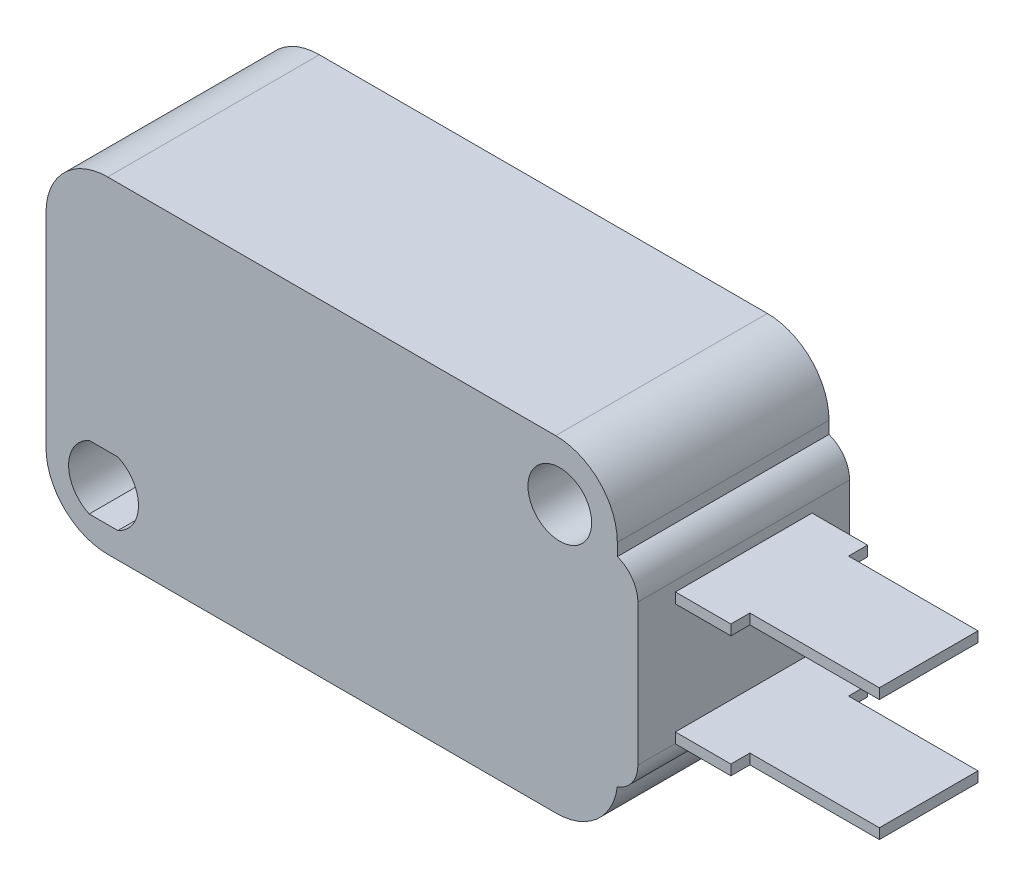
ISO-10303-21;
HEADER;
FILE_DESCRIPTION(('STEP AP214'),'2;1');
FILE_NAME('part.step','',(''),(''),'','','');
FILE_SCHEMA(('AUTOMOTIVE_DESIGN { 1 0 10303 214 1 1 1 1 }'));
ENDSEC;
DATA;
#1=APPLICATION_CONTEXT('core data for automotive mechanical design processes');
#2=APPLICATION_PROTOCOL_DEFINITION('international standard','automotive_design',2000,#1);
#3=PRODUCT_CONTEXT('',#1,'mechanical');
#4=PRODUCT('Part','Part','',(#3));
#5=PRODUCT_RELATED_PRODUCT_CATEGORY('part','',(#4));
#6=PRODUCT_DEFINITION_FORMATION('','',#4);
#7=PRODUCT_DEFINITION_CONTEXT('part definition',#1,'design');
#8=PRODUCT_DEFINITION('design','',#6,#7);
#9=PRODUCT_DEFINITION_SHAPE('','',#8);
#10=(LENGTH_UNIT() NAMED_UNIT(*) SI_UNIT(.MILLI.,.METRE.));
#11=(NAMED_UNIT(*) PLANE_ANGLE_UNIT() SI_UNIT($,.RADIAN.));
#12=(NAMED_UNIT(*) SI_UNIT($,.STERADIAN.) SOLID_ANGLE_UNIT());
#13=UNCERTAINTY_MEASURE_WITH_UNIT(LENGTH_MEASURE(1.E-05),#10,'distance_accuracy_value','');
#14=(GEOMETRIC_REPRESENTATION_CONTEXT(3) GLOBAL_UNCERTAINTY_ASSIGNED_CONTEXT((#13)) GLOBAL_UNIT_ASSIGNED_CONTEXT((#10,
#11,#12)) REPRESENTATION_CONTEXT('',''));
#15=CARTESIAN_POINT('',(0.,0.,0.));
#16=DIRECTION('',(0.,0.,1.));
#17=DIRECTION('',(1.,0.,0.));
#18=AXIS2_PLACEMENT_3D('',#15,#16,#17);
#19=CARTESIAN_POINT('',(3.8,-0.8,5.15));
#20=DIRECTION('',(-1.,0.,0.));
#21=DIRECTION('',(0.,-1.,0.));
#22=AXIS2_PLACEMENT_3D('',#19,#20,#21);
#23=PLANE('',#22);
#24=DIRECTION('',(0.,-1.,0.));
#25=VECTOR('',#24,1.);
#26=CARTESIAN_POINT('',(3.8,-2.7,3.325));
#27=LINE('',#26,#25);
#28=CARTESIAN_POINT('',(3.8,-2.7,3.325));
#29=VERTEX_POINT('',#28);
#30=CARTESIAN_POINT('',(3.8,-3.2,3.325));
#31=VERTEX_POINT('',#30);
#32=EDGE_CURVE('E455',#29,#31,#27,.T.);
#33=ORIENTED_EDGE('',*,*,#32,.F.);
#34=DIRECTION('',(0.,0.,1.));
#35=VECTOR('',#34,1.);
#36=CARTESIAN_POINT('',(3.8,-2.7,3.325));
#37=LINE('',#36,#35);
#38=CARTESIAN_POINT('',(3.8,-2.7,-3.325));
#39=VERTEX_POINT('',#38);
#40=EDGE_CURVE('E462',#39,#29,#37,.T.);
#41=ORIENTED_EDGE('',*,*,#40,.F.);
#42=DIRECTION('',(0.,1.,0.));
#43=VECTOR('',#42,1.);
#44=CARTESIAN_POINT('',(3.8,-2.7,-3.325));
#45=LINE('',#44,#43);
#46=CARTESIAN_POINT('',(3.8,-3.2,-3.325));
#47=VERTEX_POINT('',#46);
#48=EDGE_CURVE('E271',#47,#39,#45,.T.);
#49=ORIENTED_EDGE('',*,*,#48,.F.);
#50=DIRECTION('',(0.,0.,-1.));
#51=VECTOR('',#50,1.);
#52=CARTESIAN_POINT('',(3.8,-3.2,3.325));
#53=LINE('',#52,#51);
#54=EDGE_CURVE('E458',#31,#47,#53,.T.);
#55=ORIENTED_EDGE('',*,*,#54,.F.);
#56=EDGE_LOOP('',(#33,#41,#49,#55));
#57=FACE_BOUND('',#56,.T.);
#58=DIRECTION('',(0.,1.,0.));
#59=VECTOR('',#58,1.);
#60=CARTESIAN_POINT('',(3.8,-0.8,5.15));
#61=LINE('',#60,#59);
#62=CARTESIAN_POINT('',(3.8,-9.08578643762691,5.15));
#63=VERTEX_POINT('',#62);
#64=CARTESIAN_POINT('',(3.8,-2.2142135623731,5.15));
#65=VERTEX_POINT('',#64);
#66=EDGE_CURVE('E340',#63,#65,#61,.T.);
#67=ORIENTED_EDGE('',*,*,#66,.F.);
#68=DIRECTION('',(0.,0.,-1.));
#69=VECTOR('',#68,1.);
#70=CARTESIAN_POINT('',(3.8,-9.08578643762691,5.15));
#71=LINE('',#70,#69);
#72=CARTESIAN_POINT('',(3.8,-9.08578643762691,3.325));
#73=VERTEX_POINT('',#72);
#74=EDGE_CURVE('E403',#63,#73,#71,.T.);
#75=ORIENTED_EDGE('',*,*,#74,.T.);
#76=DIRECTION('',(0.,-1.,0.));
#77=VECTOR('',#76,1.);
#78=CARTESIAN_POINT('',(3.8,-8.6,3.325));
#79=LINE('',#78,#77);
#80=CARTESIAN_POINT('',(3.8,-8.6,3.325));
#81=VERTEX_POINT('',#80);
#82=EDGE_CURVE('E436',#81,#73,#79,.T.);
#83=ORIENTED_EDGE('',*,*,#82,.F.);
#84=DIRECTION('',(0.,0.,1.));
#85=VECTOR('',#84,1.);
#86=CARTESIAN_POINT('',(3.8,-8.6,3.325));
#87=LINE('',#86,#85);
#88=CARTESIAN_POINT('',(3.8,-8.6,-3.325));
#89=VERTEX_POINT('',#88);
#90=EDGE_CURVE('E435',#89,#81,#87,.T.);
#91=ORIENTED_EDGE('',*,*,#90,.F.);
#92=DIRECTION('',(0.,1.,0.));
#93=VECTOR('',#92,1.);
#94=CARTESIAN_POINT('',(3.8,-8.6,-3.325));
#95=LINE('',#94,#93);
#96=CARTESIAN_POINT('',(3.8,-9.08578643762691,-3.325));
#97=VERTEX_POINT('',#96);
#98=EDGE_CURVE('E427',#97,#89,#95,.T.);
#99=ORIENTED_EDGE('',*,*,#98,.F.);
#100=DIRECTION('',(0.,0.,-1.));
#101=VECTOR('',#100,1.);
#102=CARTESIAN_POINT('',(3.8,-9.08578643762691,5.15));
#103=LINE('',#102,#101);
#104=CARTESIAN_POINT('',(3.8,-9.08578643762691,-5.15));
#105=VERTEX_POINT('',#104);
#106=EDGE_CURVE('E401',#97,#105,#103,.T.);
#107=ORIENTED_EDGE('',*,*,#106,.T.);
#108=DIRECTION('',(0.,1.,0.));
#109=VECTOR('',#108,1.);
#110=CARTESIAN_POINT('',(3.8,-0.8,-5.15));
#111=LINE('',#110,#109);
#112=CARTESIAN_POINT('',(3.8,-2.2142135623731,-5.15));
#113=VERTEX_POINT('',#112);
#114=EDGE_CURVE('E325',#105,#113,#111,.T.);
#115=ORIENTED_EDGE('',*,*,#114,.T.);
#116=DIRECTION('',(0.,0.,-1.));
#117=VECTOR('',#116,1.);
#118=CARTESIAN_POINT('',(3.8,-2.2142135623731,5.15));
#119=LINE('',#118,#117);
#120=EDGE_CURVE('E399',#113,#65,#119,.F.);
#121=ORIENTED_EDGE('',*,*,#120,.T.);
#122=EDGE_LOOP('',(#67,#75,#83,#91,#99,#107,#115,#121));
#123=FACE_BOUND('',#122,.T.);
#124=ADVANCED_FACE('F37',(#57,#123),#23,.F.);
#125=CARTESIAN_POINT('',(-25.,2.8,5.15));
#126=DIRECTION('',(0.,-1.,0.));
#127=DIRECTION('',(0.,0.,-1.));
#128=AXIS2_PLACEMENT_3D('',#125,#126,#127);
#129=PLANE('',#128);
#130=DIRECTION('',(-1.,0.,0.));
#131=VECTOR('',#130,1.);
#132=CARTESIAN_POINT('',(-25.,2.8,-5.15));
#133=LINE('',#132,#131);
#134=CARTESIAN_POINT('',(-0.199999999999999,2.8,-5.15));
#135=VERTEX_POINT('',#134);
#136=CARTESIAN_POINT('',(-22.,2.8,-5.15));
#137=VERTEX_POINT('',#136);
#138=EDGE_CURVE('E331',#135,#137,#133,.T.);
#139=ORIENTED_EDGE('',*,*,#138,.T.);
#140=DIRECTION('',(0.,0.,-1.));
#141=VECTOR('',#140,1.);
#142=CARTESIAN_POINT('',(-22.,2.8,5.15));
#143=LINE('',#142,#141);
#144=CARTESIAN_POINT('',(-22.,2.8,5.15));
#145=VERTEX_POINT('',#144);
#146=EDGE_CURVE('E382',#137,#145,#143,.F.);
#147=ORIENTED_EDGE('',*,*,#146,.T.);
#148=DIRECTION('',(-1.,0.,0.));
#149=VECTOR('',#148,1.);
#150=CARTESIAN_POINT('',(-25.,2.8,5.15));
#151=LINE('',#150,#149);
#152=CARTESIAN_POINT('',(-0.199999999999999,2.8,5.15));
#153=VERTEX_POINT('',#152);
#154=EDGE_CURVE('E346',#153,#145,#151,.T.);
#155=ORIENTED_EDGE('',*,*,#154,.F.);
#156=DIRECTION('',(0.,0.,-1.));
#157=VECTOR('',#156,1.);
#158=CARTESIAN_POINT('',(-0.199999999999999,2.8,5.15));
#159=LINE('',#158,#157);
#160=EDGE_CURVE('E379',#153,#135,#159,.T.);
#161=ORIENTED_EDGE('',*,*,#160,.T.);
#162=EDGE_LOOP('',(#139,#147,#155,#161));
#163=FACE_BOUND('',#162,.T.);
#164=ADVANCED_FACE('F549',(#163),#129,.F.);
#165=CARTESIAN_POINT('',(-25.,-13.1,5.15));
#166=DIRECTION('',(0.,0.,1.));
#167=DIRECTION('',(1.,0.,0.));
#168=AXIS2_PLACEMENT_3D('',#165,#166,#167);
#169=PLANE('',#168);
#170=CARTESIAN_POINT('',(0.,0.,5.15));
#171=DIRECTION('',(0.,0.,1.));
#172=DIRECTION('',(1.,0.,0.));
#173=AXIS2_PLACEMENT_3D('',#170,#171,#172);
#174=CIRCLE('',#173,1.55);
#175=CARTESIAN_POINT('',(1.55,0.,5.15));
#176=VERTEX_POINT('',#175);
#177=EDGE_CURVE('E316',#176,#176,#174,.T.);
#178=ORIENTED_EDGE('',*,*,#177,.F.);
#179=EDGE_LOOP('',(#178));
#180=FACE_BOUND('',#179,.T.);
#181=CARTESIAN_POINT('',(-0.173213749463701,-10.1,5.15));
#182=DIRECTION('',(0.,0.,1.));
#183=DIRECTION('',(1.,0.,0.));
#184=AXIS2_PLACEMENT_3D('',#181,#182,#183);
#185=CIRCLE('',#184,3.);
#186=CARTESIAN_POINT('',(-0.173213749463701,-13.1,5.15));
#187=VERTEX_POINT('',#186);
#188=CARTESIAN_POINT('',(2.8,-10.5,5.15));
#189=VERTEX_POINT('',#188);
#190=EDGE_CURVE('E386',#187,#189,#185,.T.);
#191=ORIENTED_EDGE('',*,*,#190,.T.);
#192=CARTESIAN_POINT('',(2.3,-9.08578643762691,5.15));
#193=DIRECTION('',(0.,0.,1.));
#194=DIRECTION('',(1.,0.,0.));
#195=AXIS2_PLACEMENT_3D('',#192,#193,#194);
#196=CIRCLE('',#195,1.5);
#197=EDGE_CURVE('E412',#189,#63,#196,.T.);
#198=ORIENTED_EDGE('',*,*,#197,.T.);
#199=ORIENTED_EDGE('',*,*,#66,.T.);
#200=CARTESIAN_POINT('',(2.3,-2.2142135623731,5.15));
#201=DIRECTION('',(0.,0.,1.));
#202=DIRECTION('',(1.,0.,0.));
#203=AXIS2_PLACEMENT_3D('',#200,#201,#202);
#204=CIRCLE('',#203,1.5);
#205=CARTESIAN_POINT('',(2.8,-0.8,5.15));
#206=VERTEX_POINT('',#205);
#207=EDGE_CURVE('E410',#65,#206,#204,.T.);
#208=ORIENTED_EDGE('',*,*,#207,.T.);
#209=DIRECTION('',(0.,1.,0.));
#210=VECTOR('',#209,1.);
#211=CARTESIAN_POINT('',(2.8,2.8,5.15));
#212=LINE('',#211,#210);
#213=CARTESIAN_POINT('',(2.8,-0.2,5.15));
#214=VERTEX_POINT('',#213);
#215=EDGE_CURVE('E343',#206,#214,#212,.T.);
#216=ORIENTED_EDGE('',*,*,#215,.T.);
#217=CARTESIAN_POINT('',(-0.199999999999999,-0.2,5.15));
#218=DIRECTION('',(0.,0.,1.));
#219=DIRECTION('',(1.,0.,0.));
#220=AXIS2_PLACEMENT_3D('',#217,#218,#219);
#221=CIRCLE('',#220,3.);
#222=EDGE_CURVE('E384',#214,#153,#221,.T.);
#223=ORIENTED_EDGE('',*,*,#222,.T.);
#224=ORIENTED_EDGE('',*,*,#154,.T.);
#225=CARTESIAN_POINT('',(-22.,-0.2,5.15));
#226=DIRECTION('',(0.,0.,1.));
#227=DIRECTION('',(1.,0.,0.));
#228=AXIS2_PLACEMENT_3D('',#225,#226,#227);
#229=CIRCLE('',#228,3.);
#230=CARTESIAN_POINT('',(-25.,-0.2,5.15));
#231=VERTEX_POINT('',#230);
#232=EDGE_CURVE('E390',#145,#231,#229,.T.);
#233=ORIENTED_EDGE('',*,*,#232,.T.);
#234=DIRECTION('',(0.,-1.,0.));
#235=VECTOR('',#234,1.);
#236=CARTESIAN_POINT('',(-25.,2.8,5.15));
#237=LINE('',#236,#235);
#238=CARTESIAN_POINT('',(-25.,-10.1,5.15));
#239=VERTEX_POINT('',#238);
#240=EDGE_CURVE('E334',#231,#239,#237,.T.);
#241=ORIENTED_EDGE('',*,*,#240,.T.);
#242=CARTESIAN_POINT('',(-22.,-10.1,5.15));
#243=DIRECTION('',(0.,0.,1.));
#244=DIRECTION('',(1.,0.,0.));
#245=AXIS2_PLACEMENT_3D('',#242,#243,#244);
#246=CIRCLE('',#245,3.);
#247=CARTESIAN_POINT('',(-22.,-13.1,5.15));
#248=VERTEX_POINT('',#247);
#249=EDGE_CURVE('E388',#239,#248,#246,.T.);
#250=ORIENTED_EDGE('',*,*,#249,.T.);
#251=DIRECTION('',(1.,0.,0.));
#252=VECTOR('',#251,1.);
#253=CARTESIAN_POINT('',(-25.,-13.1,5.15));
#254=LINE('',#253,#252);
#255=EDGE_CURVE('E337',#248,#187,#254,.T.);
#256=ORIENTED_EDGE('',*,*,#255,.T.);
#257=EDGE_LOOP('',(#191,#198,#199,#208,#216,#223,#224,#233,#241,#250,#256));
#258=FACE_BOUND('',#257,.T.);
#259=DIRECTION('',(1.,0.,0.));
#260=VECTOR('',#259,1.);
#261=CARTESIAN_POINT('',(-22.8982120021885,-11.85,5.15));
#262=LINE('',#261,#260);
#263=CARTESIAN_POINT('',(-22.8982120021885,-11.85,5.15));
#264=VERTEX_POINT('',#263);
#265=CARTESIAN_POINT('',(-21.5017879978116,-11.85,5.15));
#266=VERTEX_POINT('',#265);
#267=EDGE_CURVE('E296',#264,#266,#262,.T.);
#268=ORIENTED_EDGE('',*,*,#267,.F.);
#269=CARTESIAN_POINT('',(-22.2,-10.3,5.15));
#270=DIRECTION('',(0.,0.,1.));
#271=DIRECTION('',(1.,0.,0.));
#272=AXIS2_PLACEMENT_3D('',#269,#270,#271);
#273=CIRCLE('',#272,1.7);
#274=CARTESIAN_POINT('',(-22.8982120021885,-8.75,5.15));
#275=VERTEX_POINT('',#274);
#276=EDGE_CURVE('E294',#275,#264,#273,.T.);
#277=ORIENTED_EDGE('',*,*,#276,.F.);
#278=DIRECTION('',(-1.,0.,0.));
#279=VECTOR('',#278,1.);
#280=CARTESIAN_POINT('',(-22.8982120021885,-8.75,5.15));
#281=LINE('',#280,#279);
#282=CARTESIAN_POINT('',(-21.5017879978116,-8.75,5.15));
#283=VERTEX_POINT('',#282);
#284=EDGE_CURVE('E301',#283,#275,#281,.T.);
#285=ORIENTED_EDGE('',*,*,#284,.F.);
#286=CARTESIAN_POINT('',(-22.2,-10.3,5.15));
#287=DIRECTION('',(0.,0.,1.));
#288=DIRECTION('',(1.,0.,0.));
#289=AXIS2_PLACEMENT_3D('',#286,#287,#288);
#290=CIRCLE('',#289,1.7);
#291=EDGE_CURVE('E298',#266,#283,#290,.T.);
#292=ORIENTED_EDGE('',*,*,#291,.F.);
#293=EDGE_LOOP('',(#268,#277,#285,#292));
#294=FACE_BOUND('',#293,.T.);
#295=ADVANCED_FACE('F554',(#180,#258,#294),#169,.T.);
#296=CARTESIAN_POINT('',(-25.,-13.1,-5.15));
#297=DIRECTION('',(0.,0.,1.));
#298=DIRECTION('',(1.,0.,0.));
#299=AXIS2_PLACEMENT_3D('',#296,#297,#298);
#300=PLANE('',#299);
#301=CARTESIAN_POINT('',(0.,0.,-5.15));
#302=DIRECTION('',(0.,0.,1.));
#303=DIRECTION('',(1.,0.,0.));
#304=AXIS2_PLACEMENT_3D('',#301,#302,#303);
#305=CIRCLE('',#304,1.55);
#306=CARTESIAN_POINT('',(1.55,0.,-5.15));
#307=VERTEX_POINT('',#306);
#308=EDGE_CURVE('E313',#307,#307,#305,.T.);
#309=ORIENTED_EDGE('',*,*,#308,.T.);
#310=EDGE_LOOP('',(#309));
#311=FACE_BOUND('',#310,.T.);
#312=ORIENTED_EDGE('',*,*,#114,.F.);
#313=CARTESIAN_POINT('',(2.3,-9.08578643762691,-5.15));
#314=DIRECTION('',(0.,0.,1.));
#315=DIRECTION('',(1.,0.,0.));
#316=AXIS2_PLACEMENT_3D('',#313,#314,#315);
#317=CIRCLE('',#316,1.5);
#318=CARTESIAN_POINT('',(2.8,-10.5,-5.15));
#319=VERTEX_POINT('',#318);
#320=EDGE_CURVE('E408',#105,#319,#317,.F.);
#321=ORIENTED_EDGE('',*,*,#320,.T.);
#322=CARTESIAN_POINT('',(-0.173213749463701,-10.1,-5.15));
#323=DIRECTION('',(0.,0.,1.));
#324=DIRECTION('',(1.,0.,0.));
#325=AXIS2_PLACEMENT_3D('',#322,#323,#324);
#326=CIRCLE('',#325,3.);
#327=CARTESIAN_POINT('',(-0.173213749463701,-13.1,-5.15));
#328=VERTEX_POINT('',#327);
#329=EDGE_CURVE('E373',#319,#328,#326,.F.);
#330=ORIENTED_EDGE('',*,*,#329,.T.);
#331=DIRECTION('',(1.,0.,0.));
#332=VECTOR('',#331,1.);
#333=CARTESIAN_POINT('',(-25.,-13.1,-5.15));
#334=LINE('',#333,#332);
#335=CARTESIAN_POINT('',(-22.,-13.1,-5.15));
#336=VERTEX_POINT('',#335);
#337=EDGE_CURVE('E322',#336,#328,#334,.T.);
#338=ORIENTED_EDGE('',*,*,#337,.F.);
#339=CARTESIAN_POINT('',(-22.,-10.1,-5.15));
#340=DIRECTION('',(0.,0.,1.));
#341=DIRECTION('',(1.,0.,0.));
#342=AXIS2_PLACEMENT_3D('',#339,#340,#341);
#343=CIRCLE('',#342,3.);
#344=CARTESIAN_POINT('',(-25.,-10.1,-5.15));
#345=VERTEX_POINT('',#344);
#346=EDGE_CURVE('E375',#336,#345,#343,.F.);
#347=ORIENTED_EDGE('',*,*,#346,.T.);
#348=DIRECTION('',(0.,-1.,0.));
#349=VECTOR('',#348,1.);
#350=CARTESIAN_POINT('',(-25.,2.8,-5.15));
#351=LINE('',#350,#349);
#352=CARTESIAN_POINT('',(-25.,-0.2,-5.15));
#353=VERTEX_POINT('',#352);
#354=EDGE_CURVE('E319',#353,#345,#351,.T.);
#355=ORIENTED_EDGE('',*,*,#354,.F.);
#356=CARTESIAN_POINT('',(-22.,-0.2,-5.15));
#357=DIRECTION('',(0.,0.,1.));
#358=DIRECTION('',(1.,0.,0.));
#359=AXIS2_PLACEMENT_3D('',#356,#357,#358);
#360=CIRCLE('',#359,3.);
#361=EDGE_CURVE('E377',#353,#137,#360,.F.);
#362=ORIENTED_EDGE('',*,*,#361,.T.);
#363=ORIENTED_EDGE('',*,*,#138,.F.);
#364=CARTESIAN_POINT('',(-0.199999999999999,-0.2,-5.15));
#365=DIRECTION('',(0.,0.,1.));
#366=DIRECTION('',(1.,0.,0.));
#367=AXIS2_PLACEMENT_3D('',#364,#365,#366);
#368=CIRCLE('',#367,3.);
#369=CARTESIAN_POINT('',(2.8,-0.2,-5.15));
#370=VERTEX_POINT('',#369);
#371=EDGE_CURVE('E371',#135,#370,#368,.F.);
#372=ORIENTED_EDGE('',*,*,#371,.T.);
#373=DIRECTION('',(0.,1.,0.));
#374=VECTOR('',#373,1.);
#375=CARTESIAN_POINT('',(2.8,2.8,-5.15));
#376=LINE('',#375,#374);
#377=CARTESIAN_POINT('',(2.8,-0.8,-5.15));
#378=VERTEX_POINT('',#377);
#379=EDGE_CURVE('E328',#378,#370,#376,.T.);
#380=ORIENTED_EDGE('',*,*,#379,.F.);
#381=CARTESIAN_POINT('',(2.3,-2.2142135623731,-5.15));
#382=DIRECTION('',(0.,0.,1.));
#383=DIRECTION('',(1.,0.,0.));
#384=AXIS2_PLACEMENT_3D('',#381,#382,#383);
#385=CIRCLE('',#384,1.5);
#386=EDGE_CURVE('E406',#378,#113,#385,.F.);
#387=ORIENTED_EDGE('',*,*,#386,.T.);
#388=EDGE_LOOP('',(#312,#321,#330,#338,#347,#355,#362,#363,#372,#380,#387));
#389=FACE_BOUND('',#388,.T.);
#390=CARTESIAN_POINT('',(-22.2,-10.3,-5.15));
#391=DIRECTION('',(0.,0.,1.));
#392=DIRECTION('',(1.,0.,0.));
#393=AXIS2_PLACEMENT_3D('',#390,#391,#392);
#394=CIRCLE('',#393,1.7);
#395=CARTESIAN_POINT('',(-22.8982120021885,-8.75,-5.15));
#396=VERTEX_POINT('',#395);
#397=CARTESIAN_POINT('',(-22.8982120021885,-11.85,-5.15));
#398=VERTEX_POINT('',#397);
#399=EDGE_CURVE('E282',#396,#398,#394,.T.);
#400=ORIENTED_EDGE('',*,*,#399,.T.);
#401=DIRECTION('',(1.,0.,0.));
#402=VECTOR('',#401,1.);
#403=CARTESIAN_POINT('',(-22.8982120021885,-11.85,-5.15));
#404=LINE('',#403,#402);
#405=CARTESIAN_POINT('',(-21.5017879978116,-11.85,-5.15));
#406=VERTEX_POINT('',#405);
#407=EDGE_CURVE('E285',#398,#406,#404,.T.);
#408=ORIENTED_EDGE('',*,*,#407,.T.);
#409=CARTESIAN_POINT('',(-22.2,-10.3,-5.15));
#410=DIRECTION('',(0.,0.,1.));
#411=DIRECTION('',(1.,0.,0.));
#412=AXIS2_PLACEMENT_3D('',#409,#410,#411);
#413=CIRCLE('',#412,1.7);
#414=CARTESIAN_POINT('',(-21.5017879978116,-8.75,-5.15));
#415=VERTEX_POINT('',#414);
#416=EDGE_CURVE('E288',#406,#415,#413,.T.);
#417=ORIENTED_EDGE('',*,*,#416,.T.);
#418=DIRECTION('',(-1.,0.,0.));
#419=VECTOR('',#418,1.);
#420=CARTESIAN_POINT('',(-22.8982120021885,-8.75,-5.15));
#421=LINE('',#420,#419);
#422=EDGE_CURVE('E291',#415,#396,#421,.T.);
#423=ORIENTED_EDGE('',*,*,#422,.T.);
#424=EDGE_LOOP('',(#400,#408,#417,#423));
#425=FACE_BOUND('',#424,.T.);
#426=ADVANCED_FACE('F566',(#311,#389,#425),#300,.F.);
#427=CARTESIAN_POINT('',(-25.,2.8,5.15));
#428=DIRECTION('',(1.,0.,0.));
#429=DIRECTION('',(0.,0.,-1.));
#430=AXIS2_PLACEMENT_3D('',#427,#428,#429);
#431=PLANE('',#430);
#432=ORIENTED_EDGE('',*,*,#240,.F.);
#433=DIRECTION('',(0.,0.,-1.));
#434=VECTOR('',#433,1.);
#435=CARTESIAN_POINT('',(-25.,-0.2,5.15));
#436=LINE('',#435,#434);
#437=EDGE_CURVE('E368',#231,#353,#436,.T.);
#438=ORIENTED_EDGE('',*,*,#437,.T.);
#439=ORIENTED_EDGE('',*,*,#354,.T.);
#440=DIRECTION('',(0.,0.,-1.));
#441=VECTOR('',#440,1.);
#442=CARTESIAN_POINT('',(-25.,-10.1,5.15));
#443=LINE('',#442,#441);
#444=EDGE_CURVE('E366',#345,#239,#443,.F.);
#445=ORIENTED_EDGE('',*,*,#444,.T.);
#446=EDGE_LOOP('',(#432,#438,#439,#445));
#447=FACE_BOUND('',#446,.T.);
#448=ADVANCED_FACE('F563',(#447),#431,.F.);
#449=CARTESIAN_POINT('',(-25.,-13.1,5.15));
#450=DIRECTION('',(0.,1.,0.));
#451=DIRECTION('',(0.,0.,1.));
#452=AXIS2_PLACEMENT_3D('',#449,#450,#451);
#453=PLANE('',#452);
#454=ORIENTED_EDGE('',*,*,#255,.F.);
#455=DIRECTION('',(0.,0.,-1.));
#456=VECTOR('',#455,1.);
#457=CARTESIAN_POINT('',(-22.,-13.1,5.15));
#458=LINE('',#457,#456);
#459=EDGE_CURVE('E394',#248,#336,#458,.T.);
#460=ORIENTED_EDGE('',*,*,#459,.T.);
#461=ORIENTED_EDGE('',*,*,#337,.T.);
#462=DIRECTION('',(0.,0.,-1.));
#463=VECTOR('',#462,1.);
#464=CARTESIAN_POINT('',(-0.173213749463701,-13.1,5.15));
#465=LINE('',#464,#463);
#466=EDGE_CURVE('E392',#328,#187,#465,.F.);
#467=ORIENTED_EDGE('',*,*,#466,.T.);
#468=EDGE_LOOP('',(#454,#460,#461,#467));
#469=FACE_BOUND('',#468,.T.);
#470=ADVANCED_FACE('F560',(#469),#453,.F.);
#471=CARTESIAN_POINT('',(2.8,2.8,5.15));
#472=DIRECTION('',(-1.,0.,0.));
#473=DIRECTION('',(0.,0.,1.));
#474=AXIS2_PLACEMENT_3D('',#471,#472,#473);
#475=PLANE('',#474);
#476=ORIENTED_EDGE('',*,*,#379,.T.);
#477=DIRECTION('',(0.,0.,-1.));
#478=VECTOR('',#477,1.);
#479=CARTESIAN_POINT('',(2.8,-0.2,5.15));
#480=LINE('',#479,#478);
#481=EDGE_CURVE('E397',#370,#214,#480,.F.);
#482=ORIENTED_EDGE('',*,*,#481,.T.);
#483=ORIENTED_EDGE('',*,*,#215,.F.);
#484=DIRECTION('',(0.,0.,-1.));
#485=VECTOR('',#484,1.);
#486=CARTESIAN_POINT('',(2.8,-0.8,5.15));
#487=LINE('',#486,#485);
#488=EDGE_CURVE('E349',#206,#378,#487,.T.);
#489=ORIENTED_EDGE('',*,*,#488,.T.);
#490=EDGE_LOOP('',(#476,#482,#483,#489));
#491=FACE_BOUND('',#490,.T.);
#492=ADVANCED_FACE('F559',(#491),#475,.F.);
#493=CARTESIAN_POINT('',(0.,0.,5.15));
#494=DIRECTION('',(0.,0.,-1.));
#495=DIRECTION('',(-1.,0.,0.));
#496=AXIS2_PLACEMENT_3D('',#493,#494,#495);
#497=CYLINDRICAL_SURFACE('',#496,1.55);
#498=ORIENTED_EDGE('',*,*,#177,.T.);
#499=EDGE_LOOP('',(#498));
#500=FACE_BOUND('',#499,.T.);
#501=ORIENTED_EDGE('',*,*,#308,.F.);
#502=EDGE_LOOP('',(#501));
#503=FACE_BOUND('',#502,.T.);
#504=ADVANCED_FACE('F680',(#500,#503),#497,.F.);
#505=CARTESIAN_POINT('',(-22.2,-10.3,5.15));
#506=DIRECTION('',(0.,0.,-1.));
#507=DIRECTION('',(-1.,0.,0.));
#508=AXIS2_PLACEMENT_3D('',#505,#506,#507);
#509=CYLINDRICAL_SURFACE('',#508,1.7);
#510=ORIENTED_EDGE('',*,*,#399,.F.);
#511=DIRECTION('',(0.,0.,-1.));
#512=VECTOR('',#511,1.);
#513=CARTESIAN_POINT('',(-22.8982120021885,-8.75,5.15));
#514=LINE('',#513,#512);
#515=EDGE_CURVE('E303',#275,#396,#514,.T.);
#516=ORIENTED_EDGE('',*,*,#515,.F.);
#517=ORIENTED_EDGE('',*,*,#276,.T.);
#518=DIRECTION('',(0.,0.,-1.));
#519=VECTOR('',#518,1.);
#520=CARTESIAN_POINT('',(-22.8982120021885,-11.85,5.15));
#521=LINE('',#520,#519);
#522=EDGE_CURVE('E310',#264,#398,#521,.T.);
#523=ORIENTED_EDGE('',*,*,#522,.T.);
#524=EDGE_LOOP('',(#510,#516,#517,#523));
#525=FACE_BOUND('',#524,.T.);
#526=ADVANCED_FACE('F676',(#525),#509,.F.);
#527=CARTESIAN_POINT('',(-22.8982120021885,-11.85,5.15));
#528=DIRECTION('',(0.,1.,0.));
#529=DIRECTION('',(0.,0.,1.));
#530=AXIS2_PLACEMENT_3D('',#527,#528,#529);
#531=PLANE('',#530);
#532=ORIENTED_EDGE('',*,*,#407,.F.);
#533=ORIENTED_EDGE('',*,*,#522,.F.);
#534=ORIENTED_EDGE('',*,*,#267,.T.);
#535=DIRECTION('',(0.,0.,-1.));
#536=VECTOR('',#535,1.);
#537=CARTESIAN_POINT('',(-21.5017879978116,-11.85,5.15));
#538=LINE('',#537,#536);
#539=EDGE_CURVE('E308',#266,#406,#538,.T.);
#540=ORIENTED_EDGE('',*,*,#539,.T.);
#541=EDGE_LOOP('',(#532,#533,#534,#540));
#542=FACE_BOUND('',#541,.T.);
#543=ADVANCED_FACE('F672',(#542),#531,.T.);
#544=CARTESIAN_POINT('',(-22.2,-10.3,5.15));
#545=DIRECTION('',(0.,0.,-1.));
#546=DIRECTION('',(-1.,0.,0.));
#547=AXIS2_PLACEMENT_3D('',#544,#545,#546);
#548=CYLINDRICAL_SURFACE('',#547,1.7);
#549=ORIENTED_EDGE('',*,*,#416,.F.);
#550=ORIENTED_EDGE('',*,*,#539,.F.);
#551=ORIENTED_EDGE('',*,*,#291,.T.);
#552=DIRECTION('',(0.,0.,-1.));
#553=VECTOR('',#552,1.);
#554=CARTESIAN_POINT('',(-21.5017879978116,-8.75,5.15));
#555=LINE('',#554,#553);
#556=EDGE_CURVE('E306',#283,#415,#555,.T.);
#557=ORIENTED_EDGE('',*,*,#556,.T.);
#558=EDGE_LOOP('',(#549,#550,#551,#557));
#559=FACE_BOUND('',#558,.T.);
#560=ADVANCED_FACE('F668',(#559),#548,.F.);
#561=CARTESIAN_POINT('',(-22.8982120021885,-8.75,5.15));
#562=DIRECTION('',(0.,-1.,0.));
#563=DIRECTION('',(0.,0.,-1.));
#564=AXIS2_PLACEMENT_3D('',#561,#562,#563);
#565=PLANE('',#564);
#566=ORIENTED_EDGE('',*,*,#422,.F.);
#567=ORIENTED_EDGE('',*,*,#556,.F.);
#568=ORIENTED_EDGE('',*,*,#284,.T.);
#569=ORIENTED_EDGE('',*,*,#515,.T.);
#570=EDGE_LOOP('',(#566,#567,#568,#569));
#571=FACE_BOUND('',#570,.T.);
#572=ADVANCED_FACE('F665',(#571),#565,.T.);
#573=CARTESIAN_POINT('',(12.8,-2.7,3.325));
#574=DIRECTION('',(0.,0.,-1.));
#575=DIRECTION('',(0.,1.,0.));
#576=AXIS2_PLACEMENT_3D('',#573,#574,#575);
#577=PLANE('',#576);
#578=DIRECTION('',(-1.,0.,0.));
#579=VECTOR('',#578,1.);
#580=CARTESIAN_POINT('',(12.8,-3.2,3.325));
#581=LINE('',#580,#579);
#582=CARTESIAN_POINT('',(6.5,-3.2,3.325));
#583=VERTEX_POINT('',#582);
#584=EDGE_CURVE('E275',#583,#31,#581,.T.);
#585=ORIENTED_EDGE('',*,*,#584,.F.);
#586=DIRECTION('',(0.,1.,0.));
#587=VECTOR('',#586,1.);
#588=CARTESIAN_POINT('',(6.5,-13.1,3.325));
#589=LINE('',#588,#587);
#590=CARTESIAN_POINT('',(6.5,-2.7,3.325));
#591=VERTEX_POINT('',#590);
#592=EDGE_CURVE('E493',#583,#591,#589,.T.);
#593=ORIENTED_EDGE('',*,*,#592,.T.);
#594=DIRECTION('',(-1.,0.,0.));
#595=VECTOR('',#594,1.);
#596=CARTESIAN_POINT('',(12.8,-2.7,3.325));
#597=LINE('',#596,#595);
#598=EDGE_CURVE('E273',#591,#29,#597,.T.);
#599=ORIENTED_EDGE('',*,*,#598,.T.);
#600=ORIENTED_EDGE('',*,*,#32,.T.);
#601=EDGE_LOOP('',(#585,#593,#599,#600));
#602=FACE_BOUND('',#601,.T.);
#603=ADVANCED_FACE('F514',(#602),#577,.F.);
#604=CARTESIAN_POINT('',(12.8,-3.2,3.325));
#605=DIRECTION('',(0.,1.,0.));
#606=DIRECTION('',(-1.,0.,0.));
#607=AXIS2_PLACEMENT_3D('',#604,#605,#606);
#608=PLANE('',#607);
#609=DIRECTION('',(0.,0.,1.));
#610=VECTOR('',#609,1.);
#611=CARTESIAN_POINT('',(6.5,-3.2,3.325));
#612=LINE('',#611,#610);
#613=CARTESIAN_POINT('',(6.5,-3.2,-3.325));
#614=VERTEX_POINT('',#613);
#615=CARTESIAN_POINT('',(6.5,-3.2,-2.4));
#616=VERTEX_POINT('',#615);
#617=EDGE_CURVE('E254',#614,#616,#612,.T.);
#618=ORIENTED_EDGE('',*,*,#617,.T.);
#619=DIRECTION('',(1.,0.,0.));
#620=VECTOR('',#619,1.);
#621=CARTESIAN_POINT('',(12.8,-3.2,-2.4));
#622=LINE('',#621,#620);
#623=CARTESIAN_POINT('',(12.8,-3.2,-2.4));
#624=VERTEX_POINT('',#623);
#625=EDGE_CURVE('E518',#616,#624,#622,.T.);
#626=ORIENTED_EDGE('',*,*,#625,.T.);
#627=DIRECTION('',(0.,0.,-1.));
#628=VECTOR('',#627,1.);
#629=CARTESIAN_POINT('',(12.8,-3.2,3.325));
#630=LINE('',#629,#628);
#631=CARTESIAN_POINT('',(12.8,-3.2,2.4));
#632=VERTEX_POINT('',#631);
#633=EDGE_CURVE('E464',#632,#624,#630,.T.);
#634=ORIENTED_EDGE('',*,*,#633,.F.);
#635=DIRECTION('',(-1.,0.,0.));
#636=VECTOR('',#635,1.);
#637=CARTESIAN_POINT('',(12.8,-3.2,2.4));
#638=LINE('',#637,#636);
#639=CARTESIAN_POINT('',(6.5,-3.2,2.4));
#640=VERTEX_POINT('',#639);
#641=EDGE_CURVE('E482',#632,#640,#638,.T.);
#642=ORIENTED_EDGE('',*,*,#641,.T.);
#643=DIRECTION('',(0.,0.,1.));
#644=VECTOR('',#643,1.);
#645=CARTESIAN_POINT('',(6.5,-3.2,3.325));
#646=LINE('',#645,#644);
#647=EDGE_CURVE('E441',#640,#583,#646,.T.);
#648=ORIENTED_EDGE('',*,*,#647,.T.);
#649=ORIENTED_EDGE('',*,*,#584,.T.);
#650=ORIENTED_EDGE('',*,*,#54,.T.);
#651=DIRECTION('',(-1.,0.,0.));
#652=VECTOR('',#651,1.);
#653=CARTESIAN_POINT('',(12.8,-3.2,-3.325));
#654=LINE('',#653,#652);
#655=EDGE_CURVE('E272',#614,#47,#654,.T.);
#656=ORIENTED_EDGE('',*,*,#655,.F.);
#657=EDGE_LOOP('',(#618,#626,#634,#642,#648,#649,#650,#656));
#658=FACE_BOUND('',#657,.T.);
#659=ADVANCED_FACE('F510',(#658),#608,.F.);
#660=CARTESIAN_POINT('',(12.8,-2.7,-3.325));
#661=DIRECTION('',(0.,0.,1.));
#662=DIRECTION('',(0.,-1.,0.));
#663=AXIS2_PLACEMENT_3D('',#660,#661,#662);
#664=PLANE('',#663);
#665=DIRECTION('',(-1.,0.,0.));
#666=VECTOR('',#665,1.);
#667=CARTESIAN_POINT('',(12.8,-2.7,-3.325));
#668=LINE('',#667,#666);
#669=CARTESIAN_POINT('',(6.5,-2.7,-3.325));
#670=VERTEX_POINT('',#669);
#671=EDGE_CURVE('E265',#670,#39,#668,.T.);
#672=ORIENTED_EDGE('',*,*,#671,.F.);
#673=DIRECTION('',(0.,1.,0.));
#674=VECTOR('',#673,1.);
#675=CARTESIAN_POINT('',(6.5,-13.1,-3.325));
#676=LINE('',#675,#674);
#677=EDGE_CURVE('E247',#614,#670,#676,.T.);
#678=ORIENTED_EDGE('',*,*,#677,.F.);
#679=ORIENTED_EDGE('',*,*,#655,.T.);
#680=ORIENTED_EDGE('',*,*,#48,.T.);
#681=EDGE_LOOP('',(#672,#678,#679,#680));
#682=FACE_BOUND('',#681,.T.);
#683=ADVANCED_FACE('F269',(#682),#664,.F.);
#684=CARTESIAN_POINT('',(12.8,-2.7,3.325));
#685=DIRECTION('',(0.,-1.,0.));
#686=DIRECTION('',(1.,0.,0.));
#687=AXIS2_PLACEMENT_3D('',#684,#685,#686);
#688=PLANE('',#687);
#689=DIRECTION('',(0.,0.,1.));
#690=VECTOR('',#689,1.);
#691=CARTESIAN_POINT('',(12.8,-2.7,3.325));
#692=LINE('',#691,#690);
#693=CARTESIAN_POINT('',(12.8,-2.7,-2.4));
#694=VERTEX_POINT('',#693);
#695=CARTESIAN_POINT('',(12.8,-2.7,2.4));
#696=VERTEX_POINT('',#695);
#697=EDGE_CURVE('E277',#694,#696,#692,.T.);
#698=ORIENTED_EDGE('',*,*,#697,.F.);
#699=DIRECTION('',(1.,0.,0.));
#700=VECTOR('',#699,1.);
#701=CARTESIAN_POINT('',(12.8,-2.7,-2.4));
#702=LINE('',#701,#700);
#703=CARTESIAN_POINT('',(6.5,-2.7,-2.4));
#704=VERTEX_POINT('',#703);
#705=EDGE_CURVE('E259',#704,#694,#702,.T.);
#706=ORIENTED_EDGE('',*,*,#705,.F.);
#707=DIRECTION('',(0.,0.,1.));
#708=VECTOR('',#707,1.);
#709=CARTESIAN_POINT('',(6.5,-2.7,-3.325));
#710=LINE('',#709,#708);
#711=EDGE_CURVE('E251',#670,#704,#710,.T.);
#712=ORIENTED_EDGE('',*,*,#711,.F.);
#713=ORIENTED_EDGE('',*,*,#671,.T.);
#714=ORIENTED_EDGE('',*,*,#40,.T.);
#715=ORIENTED_EDGE('',*,*,#598,.F.);
#716=DIRECTION('',(0.,0.,1.));
#717=VECTOR('',#716,1.);
#718=CARTESIAN_POINT('',(6.5,-2.7,3.325));
#719=LINE('',#718,#717);
#720=CARTESIAN_POINT('',(6.5,-2.7,2.4));
#721=VERTEX_POINT('',#720);
#722=EDGE_CURVE('E484',#721,#591,#719,.T.);
#723=ORIENTED_EDGE('',*,*,#722,.F.);
#724=DIRECTION('',(-1.,0.,0.));
#725=VECTOR('',#724,1.);
#726=CARTESIAN_POINT('',(12.8,-2.7,2.4));
#727=LINE('',#726,#725);
#728=EDGE_CURVE('E479',#696,#721,#727,.T.);
#729=ORIENTED_EDGE('',*,*,#728,.F.);
#730=EDGE_LOOP('',(#698,#706,#712,#713,#714,#715,#723,#729));
#731=FACE_BOUND('',#730,.T.);
#732=ADVANCED_FACE('F263',(#731),#688,.F.);
#733=CARTESIAN_POINT('',(12.8,-3.2,3.325));
#734=DIRECTION('',(1.,0.,0.));
#735=DIRECTION('',(0.,0.,-1.));
#736=AXIS2_PLACEMENT_3D('',#733,#734,#735);
#737=PLANE('',#736);
#738=DIRECTION('',(0.,1.,0.));
#739=VECTOR('',#738,1.);
#740=CARTESIAN_POINT('',(12.8,-13.1,-2.4));
#741=LINE('',#740,#739);
#742=EDGE_CURVE('E473',#624,#694,#741,.T.);
#743=ORIENTED_EDGE('',*,*,#742,.T.);
#744=ORIENTED_EDGE('',*,*,#697,.T.);
#745=DIRECTION('',(0.,1.,0.));
#746=VECTOR('',#745,1.);
#747=CARTESIAN_POINT('',(12.8,-13.1,2.4));
#748=LINE('',#747,#746);
#749=EDGE_CURVE('E471',#632,#696,#748,.T.);
#750=ORIENTED_EDGE('',*,*,#749,.F.);
#751=ORIENTED_EDGE('',*,*,#633,.T.);
#752=EDGE_LOOP('',(#743,#744,#750,#751));
#753=FACE_BOUND('',#752,.T.);
#754=ADVANCED_FACE('F470',(#753),#737,.T.);
#755=CARTESIAN_POINT('',(12.8,-8.6,3.325));
#756=DIRECTION('',(0.,0.,-1.));
#757=DIRECTION('',(0.,1.,0.));
#758=AXIS2_PLACEMENT_3D('',#755,#756,#757);
#759=PLANE('',#758);
#760=DIRECTION('',(-1.,0.,0.));
#761=VECTOR('',#760,1.);
#762=CARTESIAN_POINT('',(12.8,-9.1,3.325));
#763=LINE('',#762,#761);
#764=CARTESIAN_POINT('',(6.5,-9.1,3.325));
#765=VERTEX_POINT('',#764);
#766=CARTESIAN_POINT('',(3.79993265670318,-9.1,3.325));
#767=VERTEX_POINT('',#766);
#768=EDGE_CURVE('E58',#765,#767,#763,.T.);
#769=ORIENTED_EDGE('',*,*,#768,.F.);
#770=CARTESIAN_POINT('',(6.5,-8.6,3.325));
#771=VERTEX_POINT('',#770);
#772=EDGE_CURVE('E496',#765,#771,#589,.T.);
#773=ORIENTED_EDGE('',*,*,#772,.T.);
#774=DIRECTION('',(-1.,0.,0.));
#775=VECTOR('',#774,1.);
#776=CARTESIAN_POINT('',(12.8,-8.6,3.325));
#777=LINE('',#776,#775);
#778=EDGE_CURVE('E449',#771,#81,#777,.T.);
#779=ORIENTED_EDGE('',*,*,#778,.T.);
#780=ORIENTED_EDGE('',*,*,#82,.T.);
#781=CARTESIAN_POINT('',(2.3,-9.08578643762691,3.325));
#782=DIRECTION('',(0.,0.,-1.));
#783=DIRECTION('',(0.,1.,0.));
#784=AXIS2_PLACEMENT_3D('',#781,#782,#783);
#785=CIRCLE('',#784,1.5);
#786=EDGE_CURVE('E414',#73,#767,#785,.T.);
#787=ORIENTED_EDGE('',*,*,#786,.T.);
#788=EDGE_LOOP('',(#769,#773,#779,#780,#787));
#789=FACE_BOUND('',#788,.T.);
#790=ADVANCED_FACE('F615',(#789),#759,.F.);
#791=CARTESIAN_POINT('',(12.8,-9.1,3.325));
#792=DIRECTION('',(0.,1.,0.));
#793=DIRECTION('',(-1.,0.,0.));
#794=AXIS2_PLACEMENT_3D('',#791,#792,#793);
#795=PLANE('',#794);
#796=DIRECTION('',(0.,0.,1.));
#797=VECTOR('',#796,1.);
#798=CARTESIAN_POINT('',(6.5,-9.1,3.325));
#799=LINE('',#798,#797);
#800=CARTESIAN_POINT('',(6.5,-9.1,-3.325));
#801=VERTEX_POINT('',#800);
#802=CARTESIAN_POINT('',(6.5,-9.1,-2.4));
#803=VERTEX_POINT('',#802);
#804=EDGE_CURVE('E489',#801,#803,#799,.T.);
#805=ORIENTED_EDGE('',*,*,#804,.T.);
#806=DIRECTION('',(1.,0.,0.));
#807=VECTOR('',#806,1.);
#808=CARTESIAN_POINT('',(12.8,-9.1,-2.4));
#809=LINE('',#808,#807);
#810=CARTESIAN_POINT('',(12.8,-9.1,-2.4));
#811=VERTEX_POINT('',#810);
#812=EDGE_CURVE('E520',#803,#811,#809,.T.);
#813=ORIENTED_EDGE('',*,*,#812,.T.);
#814=DIRECTION('',(0.,0.,-1.));
#815=VECTOR('',#814,1.);
#816=CARTESIAN_POINT('',(12.8,-9.1,3.325));
#817=LINE('',#816,#815);
#818=CARTESIAN_POINT('',(12.8,-9.1,2.4));
#819=VERTEX_POINT('',#818);
#820=EDGE_CURVE('E438',#819,#811,#817,.T.);
#821=ORIENTED_EDGE('',*,*,#820,.F.);
#822=DIRECTION('',(-1.,0.,0.));
#823=VECTOR('',#822,1.);
#824=CARTESIAN_POINT('',(12.8,-9.1,2.4));
#825=LINE('',#824,#823);
#826=CARTESIAN_POINT('',(6.5,-9.1,2.4));
#827=VERTEX_POINT('',#826);
#828=EDGE_CURVE('E502',#819,#827,#825,.T.);
#829=ORIENTED_EDGE('',*,*,#828,.T.);
#830=DIRECTION('',(0.,0.,1.));
#831=VECTOR('',#830,1.);
#832=CARTESIAN_POINT('',(6.5,-9.1,3.325));
#833=LINE('',#832,#831);
#834=EDGE_CURVE('E506',#827,#765,#833,.T.);
#835=ORIENTED_EDGE('',*,*,#834,.T.);
#836=ORIENTED_EDGE('',*,*,#768,.T.);
#837=DIRECTION('',(0.,0.,-1.));
#838=VECTOR('',#837,1.);
#839=CARTESIAN_POINT('',(3.79993265670318,-9.1,3.325));
#840=LINE('',#839,#838);
#841=CARTESIAN_POINT('',(3.79993265670318,-9.1,-3.325));
#842=VERTEX_POINT('',#841);
#843=EDGE_CURVE('E45',#767,#842,#840,.T.);
#844=ORIENTED_EDGE('',*,*,#843,.T.);
#845=DIRECTION('',(-1.,0.,0.));
#846=VECTOR('',#845,1.);
#847=CARTESIAN_POINT('',(12.8,-9.1,-3.325));
#848=LINE('',#847,#846);
#849=EDGE_CURVE('E51',#801,#842,#848,.T.);
#850=ORIENTED_EDGE('',*,*,#849,.F.);
#851=EDGE_LOOP('',(#805,#813,#821,#829,#835,#836,#844,#850));
#852=FACE_BOUND('',#851,.T.);
#853=ADVANCED_FACE('F418',(#852),#795,.F.);
#854=CARTESIAN_POINT('',(12.8,-8.6,-3.325));
#855=DIRECTION('',(0.,0.,1.));
#856=DIRECTION('',(1.,0.,0.));
#857=AXIS2_PLACEMENT_3D('',#854,#855,#856);
#858=PLANE('',#857);
#859=DIRECTION('',(-1.,0.,0.));
#860=VECTOR('',#859,1.);
#861=CARTESIAN_POINT('',(12.8,-8.6,-3.325));
#862=LINE('',#861,#860);
#863=CARTESIAN_POINT('',(6.5,-8.6,-3.325));
#864=VERTEX_POINT('',#863);
#865=EDGE_CURVE('E451',#864,#89,#862,.T.);
#866=ORIENTED_EDGE('',*,*,#865,.F.);
#867=EDGE_CURVE('E258',#801,#864,#676,.T.);
#868=ORIENTED_EDGE('',*,*,#867,.F.);
#869=ORIENTED_EDGE('',*,*,#849,.T.);
#870=CARTESIAN_POINT('',(2.3,-9.08578643762691,-3.325));
#871=DIRECTION('',(0.,0.,1.));
#872=DIRECTION('',(1.,0.,0.));
#873=AXIS2_PLACEMENT_3D('',#870,#871,#872);
#874=CIRCLE('',#873,1.5);
#875=EDGE_CURVE('E11',#842,#97,#874,.T.);
#876=ORIENTED_EDGE('',*,*,#875,.T.);
#877=ORIENTED_EDGE('',*,*,#98,.T.);
#878=EDGE_LOOP('',(#866,#868,#869,#876,#877));
#879=FACE_BOUND('',#878,.T.);
#880=ADVANCED_FACE('F426',(#879),#858,.F.);
#881=CARTESIAN_POINT('',(12.8,-8.6,3.325));
#882=DIRECTION('',(0.,-1.,0.));
#883=DIRECTION('',(1.,0.,0.));
#884=AXIS2_PLACEMENT_3D('',#881,#882,#883);
#885=PLANE('',#884);
#886=DIRECTION('',(0.,0.,1.));
#887=VECTOR('',#886,1.);
#888=CARTESIAN_POINT('',(12.8,-8.6,3.325));
#889=LINE('',#888,#887);
#890=CARTESIAN_POINT('',(12.8,-8.6,-2.4));
#891=VERTEX_POINT('',#890);
#892=CARTESIAN_POINT('',(12.8,-8.6,2.4));
#893=VERTEX_POINT('',#892);
#894=EDGE_CURVE('E447',#891,#893,#889,.T.);
#895=ORIENTED_EDGE('',*,*,#894,.F.);
#896=DIRECTION('',(-1.,0.,0.));
#897=VECTOR('',#896,1.);
#898=CARTESIAN_POINT('',(12.8,-8.6,-2.4));
#899=LINE('',#898,#897);
#900=CARTESIAN_POINT('',(6.5,-8.6,-2.4));
#901=VERTEX_POINT('',#900);
#902=EDGE_CURVE('E523',#891,#901,#899,.T.);
#903=ORIENTED_EDGE('',*,*,#902,.T.);
#904=DIRECTION('',(0.,0.,-1.));
#905=VECTOR('',#904,1.);
#906=CARTESIAN_POINT('',(6.5,-8.6,3.325));
#907=LINE('',#906,#905);
#908=EDGE_CURVE('E363',#901,#864,#907,.T.);
#909=ORIENTED_EDGE('',*,*,#908,.T.);
#910=ORIENTED_EDGE('',*,*,#865,.T.);
#911=ORIENTED_EDGE('',*,*,#90,.T.);
#912=ORIENTED_EDGE('',*,*,#778,.F.);
#913=DIRECTION('',(0.,0.,-1.));
#914=VECTOR('',#913,1.);
#915=CARTESIAN_POINT('',(6.5,-8.6,3.325));
#916=LINE('',#915,#914);
#917=CARTESIAN_POINT('',(6.5,-8.6,2.4));
#918=VERTEX_POINT('',#917);
#919=EDGE_CURVE('E358',#771,#918,#916,.T.);
#920=ORIENTED_EDGE('',*,*,#919,.T.);
#921=DIRECTION('',(1.,0.,0.));
#922=VECTOR('',#921,1.);
#923=CARTESIAN_POINT('',(12.8,-8.6,2.4));
#924=LINE('',#923,#922);
#925=EDGE_CURVE('E499',#918,#893,#924,.T.);
#926=ORIENTED_EDGE('',*,*,#925,.T.);
#927=EDGE_LOOP('',(#895,#903,#909,#910,#911,#912,#920,#926));
#928=FACE_BOUND('',#927,.T.);
#929=ADVANCED_FACE('F620',(#928),#885,.F.);
#930=CARTESIAN_POINT('',(12.8,-9.1,3.325));
#931=DIRECTION('',(1.,0.,0.));
#932=DIRECTION('',(0.,0.,-1.));
#933=AXIS2_PLACEMENT_3D('',#930,#931,#932);
#934=PLANE('',#933);
#935=DIRECTION('',(0.,-1.,0.));
#936=VECTOR('',#935,1.);
#937=CARTESIAN_POINT('',(12.8,-9.1,-2.4));
#938=LINE('',#937,#936);
#939=EDGE_CURVE('E361',#891,#811,#938,.T.);
#940=ORIENTED_EDGE('',*,*,#939,.F.);
#941=ORIENTED_EDGE('',*,*,#894,.T.);
#942=DIRECTION('',(0.,1.,0.));
#943=VECTOR('',#942,1.);
#944=CARTESIAN_POINT('',(12.8,-9.1,2.4));
#945=LINE('',#944,#943);
#946=EDGE_CURVE('E355',#819,#893,#945,.T.);
#947=ORIENTED_EDGE('',*,*,#946,.F.);
#948=ORIENTED_EDGE('',*,*,#820,.T.);
#949=EDGE_LOOP('',(#940,#941,#947,#948));
#950=FACE_BOUND('',#949,.T.);
#951=ADVANCED_FACE('F628',(#950),#934,.T.);
#952=CARTESIAN_POINT('',(12.8,-13.1,2.4));
#953=DIRECTION('',(0.,0.,-1.));
#954=DIRECTION('',(0.,1.,0.));
#955=AXIS2_PLACEMENT_3D('',#952,#953,#954);
#956=PLANE('',#955);
#957=ORIENTED_EDGE('',*,*,#946,.T.);
#958=ORIENTED_EDGE('',*,*,#925,.F.);
#959=DIRECTION('',(0.,1.,0.));
#960=VECTOR('',#959,1.);
#961=CARTESIAN_POINT('',(6.5,-13.1,2.4));
#962=LINE('',#961,#960);
#963=EDGE_CURVE('E497',#827,#918,#962,.T.);
#964=ORIENTED_EDGE('',*,*,#963,.F.);
#965=ORIENTED_EDGE('',*,*,#828,.F.);
#966=EDGE_LOOP('',(#957,#958,#964,#965));
#967=FACE_BOUND('',#966,.T.);
#968=ADVANCED_FACE('F630',(#967),#956,.F.);
#969=CARTESIAN_POINT('',(6.5,-13.1,3.325));
#970=DIRECTION('',(-1.,0.,0.));
#971=DIRECTION('',(0.,-1.,0.));
#972=AXIS2_PLACEMENT_3D('',#969,#970,#971);
#973=PLANE('',#972);
#974=ORIENTED_EDGE('',*,*,#963,.T.);
#975=ORIENTED_EDGE('',*,*,#919,.F.);
#976=ORIENTED_EDGE('',*,*,#772,.F.);
#977=ORIENTED_EDGE('',*,*,#834,.F.);
#978=EDGE_LOOP('',(#974,#975,#976,#977));
#979=FACE_BOUND('',#978,.T.);
#980=ADVANCED_FACE('F634',(#979),#973,.F.);
#981=EDGE_CURVE('E483',#640,#721,#962,.T.);
#982=ORIENTED_EDGE('',*,*,#981,.T.);
#983=ORIENTED_EDGE('',*,*,#722,.T.);
#984=ORIENTED_EDGE('',*,*,#592,.F.);
#985=ORIENTED_EDGE('',*,*,#647,.F.);
#986=EDGE_LOOP('',(#982,#983,#984,#985));
#987=FACE_BOUND('',#986,.T.);
#988=ADVANCED_FACE('F636',(#987),#973,.F.);
#989=ORIENTED_EDGE('',*,*,#749,.T.);
#990=ORIENTED_EDGE('',*,*,#728,.T.);
#991=ORIENTED_EDGE('',*,*,#981,.F.);
#992=ORIENTED_EDGE('',*,*,#641,.F.);
#993=EDGE_LOOP('',(#989,#990,#991,#992));
#994=FACE_BOUND('',#993,.T.);
#995=ADVANCED_FACE('F477',(#994),#956,.F.);
#996=CARTESIAN_POINT('',(12.8,-13.1,-2.4));
#997=DIRECTION('',(0.,0.,1.));
#998=DIRECTION('',(0.,-1.,0.));
#999=AXIS2_PLACEMENT_3D('',#996,#997,#998);
#1000=PLANE('',#999);
#1001=DIRECTION('',(0.,1.,0.));
#1002=VECTOR('',#1001,1.);
#1003=CARTESIAN_POINT('',(6.5,-13.1,-2.4));
#1004=LINE('',#1003,#1002);
#1005=EDGE_CURVE('E530',#803,#901,#1004,.T.);
#1006=ORIENTED_EDGE('',*,*,#1005,.T.);
#1007=ORIENTED_EDGE('',*,*,#902,.F.);
#1008=ORIENTED_EDGE('',*,*,#939,.T.);
#1009=ORIENTED_EDGE('',*,*,#812,.F.);
#1010=EDGE_LOOP('',(#1006,#1007,#1008,#1009));
#1011=FACE_BOUND('',#1010,.T.);
#1012=ADVANCED_FACE('F536',(#1011),#1000,.F.);
#1013=CARTESIAN_POINT('',(6.5,-13.1,-3.325));
#1014=DIRECTION('',(-1.,0.,0.));
#1015=DIRECTION('',(0.,-1.,0.));
#1016=AXIS2_PLACEMENT_3D('',#1013,#1014,#1015);
#1017=PLANE('',#1016);
#1018=ORIENTED_EDGE('',*,*,#867,.T.);
#1019=ORIENTED_EDGE('',*,*,#908,.F.);
#1020=ORIENTED_EDGE('',*,*,#1005,.F.);
#1021=ORIENTED_EDGE('',*,*,#804,.F.);
#1022=EDGE_LOOP('',(#1018,#1019,#1020,#1021));
#1023=FACE_BOUND('',#1022,.T.);
#1024=ADVANCED_FACE('F544',(#1023),#1017,.F.);
#1025=ORIENTED_EDGE('',*,*,#677,.T.);
#1026=ORIENTED_EDGE('',*,*,#711,.T.);
#1027=EDGE_CURVE('E528',#616,#704,#1004,.T.);
#1028=ORIENTED_EDGE('',*,*,#1027,.F.);
#1029=ORIENTED_EDGE('',*,*,#617,.F.);
#1030=EDGE_LOOP('',(#1025,#1026,#1028,#1029));
#1031=FACE_BOUND('',#1030,.T.);
#1032=ADVANCED_FACE('F249',(#1031),#1017,.F.);
#1033=ORIENTED_EDGE('',*,*,#1027,.T.);
#1034=ORIENTED_EDGE('',*,*,#705,.T.);
#1035=ORIENTED_EDGE('',*,*,#742,.F.);
#1036=ORIENTED_EDGE('',*,*,#625,.F.);
#1037=EDGE_LOOP('',(#1033,#1034,#1035,#1036));
#1038=FACE_BOUND('',#1037,.T.);
#1039=ADVANCED_FACE('F532',(#1038),#1000,.F.);
#1040=CARTESIAN_POINT('',(-22.,-0.2,5.15));
#1041=DIRECTION('',(0.,0.,-1.));
#1042=DIRECTION('',(-1.,0.,0.));
#1043=AXIS2_PLACEMENT_3D('',#1040,#1041,#1042);
#1044=CYLINDRICAL_SURFACE('',#1043,3.);
#1045=ORIENTED_EDGE('',*,*,#232,.F.);
#1046=ORIENTED_EDGE('',*,*,#146,.F.);
#1047=ORIENTED_EDGE('',*,*,#361,.F.);
#1048=ORIENTED_EDGE('',*,*,#437,.F.);
#1049=EDGE_LOOP('',(#1045,#1046,#1047,#1048));
#1050=FACE_BOUND('',#1049,.T.);
#1051=ADVANCED_FACE('F534',(#1050),#1044,.T.);
#1052=CARTESIAN_POINT('',(-22.,-10.1,5.15));
#1053=DIRECTION('',(0.,0.,-1.));
#1054=DIRECTION('',(-1.,0.,0.));
#1055=AXIS2_PLACEMENT_3D('',#1052,#1053,#1054);
#1056=CYLINDRICAL_SURFACE('',#1055,3.);
#1057=ORIENTED_EDGE('',*,*,#249,.F.);
#1058=ORIENTED_EDGE('',*,*,#444,.F.);
#1059=ORIENTED_EDGE('',*,*,#346,.F.);
#1060=ORIENTED_EDGE('',*,*,#459,.F.);
#1061=EDGE_LOOP('',(#1057,#1058,#1059,#1060));
#1062=FACE_BOUND('',#1061,.T.);
#1063=ADVANCED_FACE('F541',(#1062),#1056,.T.);
#1064=CARTESIAN_POINT('',(-0.173213749463701,-10.1,5.15));
#1065=DIRECTION('',(0.,0.,-1.));
#1066=DIRECTION('',(-1.,0.,0.));
#1067=AXIS2_PLACEMENT_3D('',#1064,#1065,#1066);
#1068=CYLINDRICAL_SURFACE('',#1067,3.);
#1069=ORIENTED_EDGE('',*,*,#190,.F.);
#1070=ORIENTED_EDGE('',*,*,#466,.F.);
#1071=ORIENTED_EDGE('',*,*,#329,.F.);
#1072=DIRECTION('',(0.,0.,-1.));
#1073=VECTOR('',#1072,1.);
#1074=CARTESIAN_POINT('',(2.8,-10.5,5.15));
#1075=LINE('',#1074,#1073);
#1076=EDGE_CURVE('E352',#189,#319,#1075,.T.);
#1077=ORIENTED_EDGE('',*,*,#1076,.F.);
#1078=EDGE_LOOP('',(#1069,#1070,#1071,#1077));
#1079=FACE_BOUND('',#1078,.T.);
#1080=ADVANCED_FACE('F571',(#1079),#1068,.T.);
#1081=CARTESIAN_POINT('',(-0.199999999999999,-0.2,5.15));
#1082=DIRECTION('',(0.,0.,-1.));
#1083=DIRECTION('',(-1.,0.,0.));
#1084=AXIS2_PLACEMENT_3D('',#1081,#1082,#1083);
#1085=CYLINDRICAL_SURFACE('',#1084,3.);
#1086=ORIENTED_EDGE('',*,*,#222,.F.);
#1087=ORIENTED_EDGE('',*,*,#481,.F.);
#1088=ORIENTED_EDGE('',*,*,#371,.F.);
#1089=ORIENTED_EDGE('',*,*,#160,.F.);
#1090=EDGE_LOOP('',(#1086,#1087,#1088,#1089));
#1091=FACE_BOUND('',#1090,.T.);
#1092=ADVANCED_FACE('F575',(#1091),#1085,.T.);
#1093=CARTESIAN_POINT('',(2.3,-9.08578643762691,5.15));
#1094=DIRECTION('',(0.,0.,-1.));
#1095=DIRECTION('',(-1.,0.,0.));
#1096=AXIS2_PLACEMENT_3D('',#1093,#1094,#1095);
#1097=CYLINDRICAL_SURFACE('',#1096,1.5);
#1098=ORIENTED_EDGE('',*,*,#197,.F.);
#1099=ORIENTED_EDGE('',*,*,#1076,.T.);
#1100=ORIENTED_EDGE('',*,*,#320,.F.);
#1101=ORIENTED_EDGE('',*,*,#106,.F.);
#1102=ORIENTED_EDGE('',*,*,#875,.F.);
#1103=ORIENTED_EDGE('',*,*,#843,.F.);
#1104=ORIENTED_EDGE('',*,*,#786,.F.);
#1105=ORIENTED_EDGE('',*,*,#74,.F.);
#1106=EDGE_LOOP('',(#1098,#1099,#1100,#1101,#1102,#1103,#1104,#1105));
#1107=FACE_BOUND('',#1106,.T.);
#1108=ADVANCED_FACE('F422',(#1107),#1097,.T.);
#1109=CARTESIAN_POINT('',(2.3,-2.2142135623731,5.15));
#1110=DIRECTION('',(0.,0.,-1.));
#1111=DIRECTION('',(-1.,0.,0.));
#1112=AXIS2_PLACEMENT_3D('',#1109,#1110,#1111);
#1113=CYLINDRICAL_SURFACE('',#1112,1.5);
#1114=ORIENTED_EDGE('',*,*,#207,.F.);
#1115=ORIENTED_EDGE('',*,*,#120,.F.);
#1116=ORIENTED_EDGE('',*,*,#386,.F.);
#1117=ORIENTED_EDGE('',*,*,#488,.F.);
#1118=EDGE_LOOP('',(#1114,#1115,#1116,#1117));
#1119=FACE_BOUND('',#1118,.T.);
#1120=ADVANCED_FACE('F39',(#1119),#1113,.T.);
#1121=CLOSED_SHELL('',(#124,#164,#295,#426,#448,#470,#492,#504,#526,#543,#560,#572,#603,#659,
#683,#732,#754,#790,#853,#880,#929,#951,#968,#980,#988,#995,#1012,#1024,#1032,#1039,#1051,#1063,
#1080,#1092,#1108,#1120));
#1122=MANIFOLD_SOLID_BREP('B2',#1121);
#1123=ADVANCED_BREP_SHAPE_REPRESENTATION('',(#18,#1122),#14);
#1124=SHAPE_DEFINITION_REPRESENTATION(#9,#1123);
ENDSEC;
END-ISO-10303-21;
